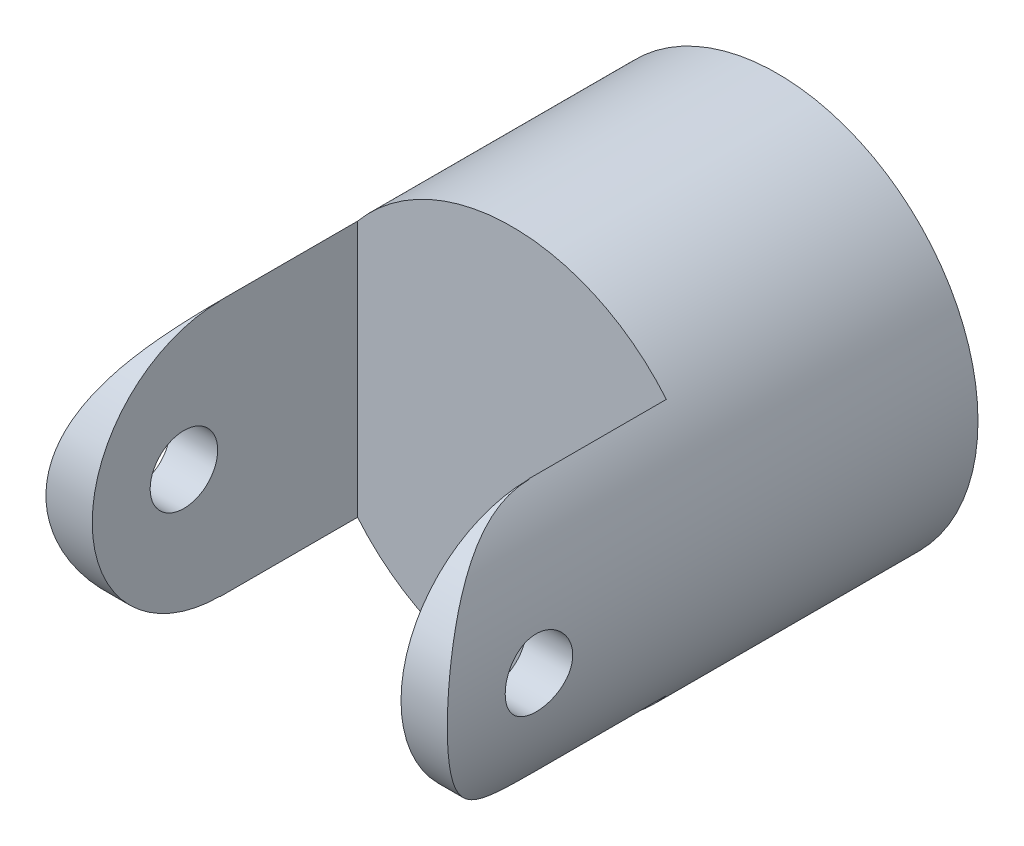
ISO-10303-21;
HEADER;
FILE_DESCRIPTION(('STEP AP214'),'2;1');
FILE_NAME('part.step','',(''),(''),'','','');
FILE_SCHEMA(('AUTOMOTIVE_DESIGN { 1 0 10303 214 1 1 1 1 }'));
ENDSEC;
DATA;
#1=APPLICATION_CONTEXT('core data for automotive mechanical design processes');
#2=APPLICATION_PROTOCOL_DEFINITION('international standard','automotive_design',2000,#1);
#3=PRODUCT_CONTEXT('',#1,'mechanical');
#4=PRODUCT('Part','Part','',(#3));
#5=PRODUCT_RELATED_PRODUCT_CATEGORY('part','',(#4));
#6=PRODUCT_DEFINITION_FORMATION('','',#4);
#7=PRODUCT_DEFINITION_CONTEXT('part definition',#1,'design');
#8=PRODUCT_DEFINITION('design','',#6,#7);
#9=PRODUCT_DEFINITION_SHAPE('','',#8);
#10=(LENGTH_UNIT() NAMED_UNIT(*) SI_UNIT(.MILLI.,.METRE.));
#11=(NAMED_UNIT(*) PLANE_ANGLE_UNIT() SI_UNIT($,.RADIAN.));
#12=(NAMED_UNIT(*) SI_UNIT($,.STERADIAN.) SOLID_ANGLE_UNIT());
#13=UNCERTAINTY_MEASURE_WITH_UNIT(LENGTH_MEASURE(1.E-05),#10,'distance_accuracy_value','');
#14=(GEOMETRIC_REPRESENTATION_CONTEXT(3) GLOBAL_UNCERTAINTY_ASSIGNED_CONTEXT((#13)) GLOBAL_UNIT_ASSIGNED_CONTEXT((#10,
#11,#12)) REPRESENTATION_CONTEXT('',''));
#15=CARTESIAN_POINT('',(0.,0.,0.));
#16=DIRECTION('',(0.,0.,1.));
#17=DIRECTION('',(1.,0.,0.));
#18=AXIS2_PLACEMENT_3D('',#15,#16,#17);
#19=CARTESIAN_POINT('',(0.,0.,11.));
#20=DIRECTION('',(0.,0.,-1.));
#21=DIRECTION('',(-1.,0.,0.));
#22=AXIS2_PLACEMENT_3D('',#19,#20,#21);
#23=CYLINDRICAL_SURFACE('',#22,4.16);
#24=CARTESIAN_POINT('',(-4.16,0.,8.4));
#25=CARTESIAN_POINT('',(-4.1599993277621,0.0390239125747628,8.40000155977883));
#26=CARTESIAN_POINT('',(-4.15944517372982,0.0780689849075887,8.4032743076211));
#27=CARTESIAN_POINT('',(-4.15728790947244,0.155063659220866,8.41627316724561));
#28=CARTESIAN_POINT('',(-4.1556838404645,0.193012226766777,8.42600517774355));
#29=CARTESIAN_POINT('',(-4.15160662871372,0.266688829253378,8.4516200868742));
#30=CARTESIAN_POINT('',(-4.1491342024726,0.302418666403529,8.46749791554888));
#31=CARTESIAN_POINT('',(-4.14359199062741,0.37070263465631,8.50494038987474));
#32=CARTESIAN_POINT('',(-4.14052227188301,0.403257120589323,8.52650439912268));
#33=CARTESIAN_POINT('',(-4.13409224580627,0.46458772784988,8.57493043107718));
#34=CARTESIAN_POINT('',(-4.13072963903228,0.493328446142046,8.6018369904627));
#35=CARTESIAN_POINT('',(-4.12411038432244,0.545909827859605,8.66008848698301));
#36=CARTESIAN_POINT('',(-4.12085374315079,0.569750178990013,8.69143370677385));
#37=CARTESIAN_POINT('',(-4.11479287163596,0.61199635700962,8.75791645283517));
#38=CARTESIAN_POINT('',(-4.11199161196014,0.630367102184491,8.79307656609853));
#39=CARTESIAN_POINT('',(-4.10719060804984,0.660928230525133,8.86603863677661));
#40=CARTESIAN_POINT('',(-4.10519080860076,0.673119039457476,8.90384041198986));
#41=CARTESIAN_POINT('',(-4.1022420557679,0.69086254711526,8.98063721227013));
#42=CARTESIAN_POINT('',(-4.10128342559077,0.696476412201096,9.01961772655558));
#43=CARTESIAN_POINT('',(-4.10049628461693,0.701096337075264,9.09797832626149));
#44=CARTESIAN_POINT('',(-4.10066769229779,0.700102873524991,9.13735838265381));
#45=CARTESIAN_POINT('',(-4.1021124270041,0.691586147504626,9.21496310071234));
#46=CARTESIAN_POINT('',(-4.10337414803079,0.68413165787628,9.25319555739738));
#47=CARTESIAN_POINT('',(-4.10683917312899,0.663012441156744,9.32785926339887));
#48=CARTESIAN_POINT('',(-4.10904251006289,0.649347497319705,9.3642904498015));
#49=CARTESIAN_POINT('',(-4.11415501382972,0.616125724703303,9.43452301139548));
#50=CARTESIAN_POINT('',(-4.11706758136741,0.596540395518846,9.46831064744649));
#51=CARTESIAN_POINT('',(-4.12326802042378,0.552054037069553,9.53214599064827));
#52=CARTESIAN_POINT('',(-4.12655592279497,0.527152570671694,9.56219338992663));
#53=CARTESIAN_POINT('',(-4.13318753266133,0.47236637629369,9.61809336013438));
#54=CARTESIAN_POINT('',(-4.13653142033276,0.442422655344115,9.64388812707109));
#55=CARTESIAN_POINT('',(-4.14285984072331,0.37860130707401,9.69009584686133));
#56=CARTESIAN_POINT('',(-4.14584437104319,0.344723653491564,9.71050876378405));
#57=CARTESIAN_POINT('',(-4.1511221620187,0.273941318469586,9.74537883203141));
#58=CARTESIAN_POINT('',(-4.15341482187015,0.237034041344438,9.75983081098754));
#59=CARTESIAN_POINT('',(-4.1570457409022,0.161268902511086,9.78231477164084));
#60=CARTESIAN_POINT('',(-4.15838408148438,0.122411207472467,9.7903473009117));
#61=CARTESIAN_POINT('',(-4.15994460407459,0.0443464102274835,9.79968583493131));
#62=CARTESIAN_POINT('',(-4.16017995079601,0.00514905333311402,9.80107118148655));
#63=CARTESIAN_POINT('',(-4.1595440480163,-0.0729176566416257,9.79728764814687));
#64=CARTESIAN_POINT('',(-4.15867284194514,-0.111787022534712,9.79211902548208));
#65=CARTESIAN_POINT('',(-4.15592987811917,-0.187848839546986,9.77544026231971));
#66=CARTESIAN_POINT('',(-4.15406433008375,-0.225050161244746,9.76396946569981));
#67=CARTESIAN_POINT('',(-4.14954102253772,-0.297001702403252,9.73505395660164));
#68=CARTESIAN_POINT('',(-4.14688321783,-0.331751781884226,9.71760890329211));
#69=CARTESIAN_POINT('',(-4.14103756729968,-0.398158605742829,9.67705881107004));
#70=CARTESIAN_POINT('',(-4.13784517038284,-0.429784726143966,9.6539042896113));
#71=CARTESIAN_POINT('',(-4.13129802571993,-0.488730817092044,9.60266051997944));
#72=CARTESIAN_POINT('',(-4.12794326595238,-0.516050468145263,9.57457090600211));
#73=CARTESIAN_POINT('',(-4.12140684889181,-0.565902760035183,9.51389821469653));
#74=CARTESIAN_POINT('',(-4.11822739594523,-0.588381753338073,9.4812707822775));
#75=CARTESIAN_POINT('',(-4.11244297967972,-0.62753977754453,9.41265632538366));
#76=CARTESIAN_POINT('',(-4.10983799789771,-0.6442189948586,9.37666940893314));
#77=CARTESIAN_POINT('',(-4.1055140656407,-0.671224072877987,9.30250651334735));
#78=CARTESIAN_POINT('',(-4.10379141775969,-0.681576481831249,9.26434042661519));
#79=CARTESIAN_POINT('',(-4.10141798088834,-0.695717505748562,9.18677960808961));
#80=CARTESIAN_POINT('',(-4.10076709673286,-0.699506703481541,9.14738498569812));
#81=CARTESIAN_POINT('',(-4.10061503803945,-0.70039725202405,9.06902118945909));
#82=CARTESIAN_POINT('',(-4.10109934457034,-0.697583058792982,9.0300529778608));
#83=CARTESIAN_POINT('',(-4.10313125058084,-0.685529497995793,8.9531529833514));
#84=CARTESIAN_POINT('',(-4.10467884642083,-0.676290152422942,8.91522119689308));
#85=CARTESIAN_POINT('',(-4.10865739445353,-0.651681156604191,8.84150439132123));
#86=CARTESIAN_POINT('',(-4.11108727872626,-0.636318915311279,8.80571683758478));
#87=CARTESIAN_POINT('',(-4.11655762981038,-0.599908920025351,8.73721334940979));
#88=CARTESIAN_POINT('',(-4.1195981278615,-0.578860875120836,8.70449757225273));
#89=CARTESIAN_POINT('',(-4.12599307843607,-0.531375902753995,8.64263988511162));
#90=CARTESIAN_POINT('',(-4.12935088277078,-0.504876889588195,8.61354597472536));
#91=CARTESIAN_POINT('',(-4.13597549546759,-0.447373004296234,8.56018888428044));
#92=CARTESIAN_POINT('',(-4.13924228266241,-0.416367094283321,8.53592681999919));
#93=CARTESIAN_POINT('',(-4.14534350893309,-0.350469460605587,8.49276545794503));
#94=CARTESIAN_POINT('',(-4.14817473607019,-0.315551872090762,8.47390519165113));
#95=CARTESIAN_POINT('',(-4.15305458015047,-0.243010434628081,8.44234710952398));
#96=CARTESIAN_POINT('',(-4.15510397288708,-0.205389312618788,8.42964318151871));
#97=CARTESIAN_POINT('',(-4.15774414448338,-0.139687071677165,8.41350289017298));
#98=CARTESIAN_POINT('',(-4.15858555014462,-0.112002502096261,8.40844745508329));
#99=CARTESIAN_POINT('',(-4.15971371512396,-0.0562156106525505,8.40169547796901));
#100=CARTESIAN_POINT('',(-4.16000048428827,-0.028113296214703,8.39999887631656));
#101=CARTESIAN_POINT('',(-4.16,0.,8.4));
#102=B_SPLINE_CURVE_WITH_KNOTS('',3,(#24,#25,#26,#27,#28,#29,#30,#31,#32,#33,#34,#35,#36,#37,
#38,#39,#40,#41,#42,#43,#44,#45,#46,#47,#48,#49,#50,#51,#52,#53,#54,#55,#56,#57,#58,#59,#60,#61,
#62,#63,#64,#65,#66,#67,#68,#69,#70,#71,#72,#73,#74,#75,#76,#77,#78,#79,#80,#81,#82,#83,#84,#85,
#86,#87,#88,#89,#90,#91,#92,#93,#94,#95,#96,#97,#98,#99,#100,#101),.UNSPECIFIED.,.T.,.F.,(4,2,2,
2,2,2,2,2,2,2,2,2,2,2,2,2,2,2,2,2,2,2,2,2,2,2,2,2,2,2,2,2,2,2,2,2,2,2,4),(0.,0.116968971867076,
0.234044909163309,0.351024470460435,0.467990944836635,0.585976836802057,0.703970245548359,
0.82270491376216,0.941431400641504,1.05904472417866,1.1766495630277,1.29301774815333,
1.40938999485922,1.52633162208068,1.6432828688337,1.76171192378295,1.88014176937935,
1.99867416270379,2.11719644423498,2.23430044546542,2.35139985074145,2.46777638798962,
2.58415956562407,2.70158922800758,2.81902759831333,2.93770721667888,3.05638302021214,
3.17455736019733,3.29272120655945,3.409382015381,3.52604242487508,3.64256209702446,
3.75908773197823,3.87702241655098,3.99498430328666,4.11377819537088,4.23245390293315,
4.31672125379096,4.4009871086749),.UNSPECIFIED.);
#103=CARTESIAN_POINT('',(-4.16,0.,8.4));
#104=VERTEX_POINT('',#103);
#105=EDGE_CURVE('E133',#104,#104,#102,.T.);
#106=ORIENTED_EDGE('',*,*,#105,.T.);
#107=EDGE_LOOP('',(#106));
#108=FACE_BOUND('',#107,.T.);
#109=CARTESIAN_POINT('',(4.16,0.,8.4));
#110=CARTESIAN_POINT('',(4.1599993277621,-0.0390239125747628,8.40000155977883));
#111=CARTESIAN_POINT('',(4.15944517372982,-0.0780689849075887,8.4032743076211));
#112=CARTESIAN_POINT('',(4.15728790947244,-0.155063659220866,8.41627316724561));
#113=CARTESIAN_POINT('',(4.1556838404645,-0.193012226766777,8.42600517774355));
#114=CARTESIAN_POINT('',(4.15160662871372,-0.266688829253378,8.4516200868742));
#115=CARTESIAN_POINT('',(4.1491342024726,-0.302418666403529,8.46749791554888));
#116=CARTESIAN_POINT('',(4.14359199062741,-0.37070263465631,8.50494038987474));
#117=CARTESIAN_POINT('',(4.14052227188301,-0.403257120589323,8.52650439912268));
#118=CARTESIAN_POINT('',(4.13409224580627,-0.46458772784988,8.57493043107718));
#119=CARTESIAN_POINT('',(4.13072963903228,-0.493328446142046,8.6018369904627));
#120=CARTESIAN_POINT('',(4.12411038432244,-0.545909827859605,8.66008848698301));
#121=CARTESIAN_POINT('',(4.12085374315079,-0.569750178990013,8.69143370677385));
#122=CARTESIAN_POINT('',(4.11479287163596,-0.61199635700962,8.75791645283517));
#123=CARTESIAN_POINT('',(4.11199161196014,-0.630367102184491,8.79307656609853));
#124=CARTESIAN_POINT('',(4.10719060804984,-0.660928230525133,8.86603863677661));
#125=CARTESIAN_POINT('',(4.10519080860076,-0.673119039457476,8.90384041198986));
#126=CARTESIAN_POINT('',(4.1022420557679,-0.69086254711526,8.98063721227013));
#127=CARTESIAN_POINT('',(4.10128342559077,-0.696476412201096,9.01961772655558));
#128=CARTESIAN_POINT('',(4.10049628461693,-0.701096337075264,9.09797832626149));
#129=CARTESIAN_POINT('',(4.10066769229779,-0.700102873524991,9.13735838265381));
#130=CARTESIAN_POINT('',(4.1021124270041,-0.691586147504626,9.21496310071234));
#131=CARTESIAN_POINT('',(4.10337414803079,-0.68413165787628,9.25319555739738));
#132=CARTESIAN_POINT('',(4.10683917312899,-0.663012441156744,9.32785926339887));
#133=CARTESIAN_POINT('',(4.10904251006289,-0.649347497319705,9.3642904498015));
#134=CARTESIAN_POINT('',(4.11415501382972,-0.616125724703303,9.43452301139548));
#135=CARTESIAN_POINT('',(4.11706758136741,-0.596540395518846,9.46831064744649));
#136=CARTESIAN_POINT('',(4.12326802042378,-0.552054037069553,9.53214599064827));
#137=CARTESIAN_POINT('',(4.12655592279497,-0.527152570671694,9.56219338992663));
#138=CARTESIAN_POINT('',(4.13318753266133,-0.47236637629369,9.61809336013438));
#139=CARTESIAN_POINT('',(4.13653142033276,-0.442422655344115,9.64388812707109));
#140=CARTESIAN_POINT('',(4.14285984072331,-0.37860130707401,9.69009584686133));
#141=CARTESIAN_POINT('',(4.14584437104319,-0.344723653491564,9.71050876378405));
#142=CARTESIAN_POINT('',(4.1511221620187,-0.273941318469586,9.74537883203141));
#143=CARTESIAN_POINT('',(4.15341482187015,-0.237034041344438,9.75983081098754));
#144=CARTESIAN_POINT('',(4.1570457409022,-0.161268902511086,9.78231477164084));
#145=CARTESIAN_POINT('',(4.15838408148438,-0.122411207472467,9.7903473009117));
#146=CARTESIAN_POINT('',(4.15994460407459,-0.0443464102274835,9.79968583493131));
#147=CARTESIAN_POINT('',(4.16017995079601,-0.00514905333311402,9.80107118148655));
#148=CARTESIAN_POINT('',(4.1595440480163,0.0729176566416257,9.79728764814687));
#149=CARTESIAN_POINT('',(4.15867284194514,0.111787022534712,9.79211902548208));
#150=CARTESIAN_POINT('',(4.15592987811917,0.187848839546986,9.77544026231971));
#151=CARTESIAN_POINT('',(4.15406433008375,0.225050161244746,9.76396946569981));
#152=CARTESIAN_POINT('',(4.14954102253772,0.297001702403252,9.73505395660164));
#153=CARTESIAN_POINT('',(4.14688321783,0.331751781884226,9.71760890329211));
#154=CARTESIAN_POINT('',(4.14103756729968,0.398158605742829,9.67705881107004));
#155=CARTESIAN_POINT('',(4.13784517038284,0.429784726143966,9.6539042896113));
#156=CARTESIAN_POINT('',(4.13129802571993,0.488730817092044,9.60266051997944));
#157=CARTESIAN_POINT('',(4.12794326595238,0.516050468145263,9.57457090600211));
#158=CARTESIAN_POINT('',(4.12140684889181,0.565902760035183,9.51389821469653));
#159=CARTESIAN_POINT('',(4.11822739594523,0.588381753338073,9.4812707822775));
#160=CARTESIAN_POINT('',(4.11244297967972,0.62753977754453,9.41265632538366));
#161=CARTESIAN_POINT('',(4.10983799789771,0.6442189948586,9.37666940893314));
#162=CARTESIAN_POINT('',(4.1055140656407,0.671224072877987,9.30250651334735));
#163=CARTESIAN_POINT('',(4.10379141775969,0.681576481831249,9.26434042661519));
#164=CARTESIAN_POINT('',(4.10141798088834,0.695717505748562,9.18677960808961));
#165=CARTESIAN_POINT('',(4.10076709673286,0.699506703481541,9.14738498569812));
#166=CARTESIAN_POINT('',(4.10061503803945,0.70039725202405,9.06902118945909));
#167=CARTESIAN_POINT('',(4.10109934457034,0.697583058792982,9.0300529778608));
#168=CARTESIAN_POINT('',(4.10313125058084,0.685529497995793,8.9531529833514));
#169=CARTESIAN_POINT('',(4.10467884642083,0.676290152422942,8.91522119689308));
#170=CARTESIAN_POINT('',(4.10865739445353,0.651681156604191,8.84150439132123));
#171=CARTESIAN_POINT('',(4.11108727872626,0.636318915311279,8.80571683758478));
#172=CARTESIAN_POINT('',(4.11655762981038,0.599908920025351,8.73721334940979));
#173=CARTESIAN_POINT('',(4.1195981278615,0.578860875120836,8.70449757225273));
#174=CARTESIAN_POINT('',(4.12599307843607,0.531375902753995,8.64263988511162));
#175=CARTESIAN_POINT('',(4.12935088277078,0.504876889588195,8.61354597472536));
#176=CARTESIAN_POINT('',(4.13597549546759,0.447373004296234,8.56018888428044));
#177=CARTESIAN_POINT('',(4.13924228266241,0.416367094283321,8.53592681999919));
#178=CARTESIAN_POINT('',(4.14534350893309,0.350469460605587,8.49276545794503));
#179=CARTESIAN_POINT('',(4.14817473607019,0.315551872090762,8.47390519165113));
#180=CARTESIAN_POINT('',(4.15305458015047,0.243010434628081,8.44234710952398));
#181=CARTESIAN_POINT('',(4.15510397288708,0.205389312618788,8.42964318151871));
#182=CARTESIAN_POINT('',(4.15774414448338,0.139687071677165,8.41350289017298));
#183=CARTESIAN_POINT('',(4.15858555014462,0.112002502096261,8.40844745508329));
#184=CARTESIAN_POINT('',(4.15971371512396,0.0562156106525505,8.40169547796901));
#185=CARTESIAN_POINT('',(4.16000048428827,0.028113296214703,8.39999887631656));
#186=CARTESIAN_POINT('',(4.16,0.,8.4));
#187=B_SPLINE_CURVE_WITH_KNOTS('',3,(#109,#110,#111,#112,#113,#114,#115,#116,#117,#118,#119,
#120,#121,#122,#123,#124,#125,#126,#127,#128,#129,#130,#131,#132,#133,#134,#135,#136,#137,#138,
#139,#140,#141,#142,#143,#144,#145,#146,#147,#148,#149,#150,#151,#152,#153,#154,#155,#156,#157,
#158,#159,#160,#161,#162,#163,#164,#165,#166,#167,#168,#169,#170,#171,#172,#173,#174,#175,#176,
#177,#178,#179,#180,#181,#182,#183,#184,#185,#186),.UNSPECIFIED.,.T.,.F.,(4,2,2,2,2,2,2,2,2,2,2,
2,2,2,2,2,2,2,2,2,2,2,2,2,2,2,2,2,2,2,2,2,2,2,2,2,2,2,4),(0.,0.116968971867076,
0.234044909163309,0.351024470460435,0.467990944836635,0.585976836802057,0.703970245548359,
0.82270491376216,0.941431400641504,1.05904472417866,1.1766495630277,1.29301774815333,
1.40938999485922,1.52633162208068,1.6432828688337,1.76171192378295,1.88014176937935,
1.99867416270379,2.11719644423498,2.23430044546542,2.35139985074145,2.46777638798962,
2.58415956562407,2.70158922800758,2.81902759831333,2.93770721667888,3.05638302021214,
3.17455736019733,3.29272120655945,3.409382015381,3.52604242487508,3.64256209702446,
3.75908773197823,3.87702241655098,3.99498430328666,4.11377819537088,4.23245390293315,
4.31672125379096,4.4009871086749),.UNSPECIFIED.);
#188=CARTESIAN_POINT('',(4.16,0.,8.4));
#189=VERTEX_POINT('',#188);
#190=EDGE_CURVE('E140',#189,#189,#187,.T.);
#191=ORIENTED_EDGE('',*,*,#190,.T.);
#192=EDGE_LOOP('',(#191));
#193=FACE_BOUND('',#192,.T.);
#194=DIRECTION('',(0.,0.,-1.));
#195=VECTOR('',#194,1.);
#196=CARTESIAN_POINT('',(3.2,2.65811963613378,11.));
#197=LINE('',#196,#195);
#198=CARTESIAN_POINT('',(3.2,2.65811963613378,5.5));
#199=VERTEX_POINT('',#198);
#200=CARTESIAN_POINT('',(3.2,2.65811963613378,8.35));
#201=VERTEX_POINT('',#200);
#202=EDGE_CURVE('E184',#199,#201,#197,.F.);
#203=ORIENTED_EDGE('',*,*,#202,.T.);
#204=CARTESIAN_POINT('',(0.,0.,8.35));
#205=DIRECTION('',(0.,0.,-1.));
#206=DIRECTION('',(-1.,0.,0.));
#207=AXIS2_PLACEMENT_3D('',#204,#205,#206);
#208=CIRCLE('',#207,4.16);
#209=CARTESIAN_POINT('',(3.20672730365399,2.65,8.35));
#210=VERTEX_POINT('',#209);
#211=EDGE_CURVE('E109',#201,#210,#208,.T.);
#212=ORIENTED_EDGE('',*,*,#211,.T.);
#213=CARTESIAN_POINT('',(3.20672730365399,2.65,8.35));
#214=CARTESIAN_POINT('',(3.20669505811809,2.6500160283953,8.41600762728984));
#215=CARTESIAN_POINT('',(3.20876451539116,2.64753446292586,8.48199574117056));
#216=CARTESIAN_POINT('',(3.21686000468512,2.63770436351235,8.6132897334531));
#217=CARTESIAN_POINT('',(3.22288144484862,2.63036147790947,8.67859631438047));
#218=CARTESIAN_POINT('',(3.23856426362669,2.61102379201802,8.8074575561479));
#219=CARTESIAN_POINT('',(3.24819241085993,2.59907143356764,8.87102269200466));
#220=CARTESIAN_POINT('',(3.27067722024509,2.57071954376607,8.99656510040091));
#221=CARTESIAN_POINT('',(3.28353467768257,2.55431891685561,9.05854197764881));
#222=CARTESIAN_POINT('',(3.32611454748676,2.49894471907308,9.24098633080575));
#223=CARTESIAN_POINT('',(3.35993644993818,2.45369268273078,9.35865168939531));
#224=CARTESIAN_POINT('',(3.43457647325418,2.34807721097754,9.58478456622257));
#225=CARTESIAN_POINT('',(3.47541252786229,2.28767485244232,9.69322741462268));
#226=CARTESIAN_POINT('',(3.56626107151885,2.14373021273325,9.91416620206438));
#227=CARTESIAN_POINT('',(3.61676021769055,2.05813888489881,10.0251318104465));
#228=CARTESIAN_POINT('',(3.71728722279422,1.87049295958019,10.2323745995469));
#229=CARTESIAN_POINT('',(3.76731489010916,1.76843195013416,10.3286460310212));
#230=CARTESIAN_POINT('',(3.86884717703238,1.5348454058189,10.5160688473868));
#231=CARTESIAN_POINT('',(3.91972805251957,1.40122264248246,10.6050055882579));
#232=CARTESIAN_POINT('',(3.98736678964662,1.18831579844764,10.7200076573631));
#233=CARTESIAN_POINT('',(4.00847126438806,1.11524286278054,10.7552827883369));
#234=CARTESIAN_POINT('',(4.04716932801902,0.965395181767101,10.8192372236001));
#235=CARTESIAN_POINT('',(4.06476539462032,0.888623096755101,10.8479211849109));
#236=CARTESIAN_POINT('',(4.09424894951388,0.740165723076318,10.8956013634813));
#237=CARTESIAN_POINT('',(4.10654021793189,0.66878394332158,10.9152955999517));
#238=CARTESIAN_POINT('',(4.1274934437329,0.524149274703781,10.9487057885936));
#239=CARTESIAN_POINT('',(4.13615753349387,0.450897512134977,10.9624252534582));
#240=CARTESIAN_POINT('',(4.14959852568186,0.303189053306739,10.9836545651541));
#241=CARTESIAN_POINT('',(4.1543779963417,0.228733186382834,10.9911685146823));
#242=CARTESIAN_POINT('',(4.1599167354821,0.0793302960709673,10.9998707866687));
#243=CARTESIAN_POINT('',(4.16067649481135,0.00438333376997673,11.0010598814578));
#244=CARTESIAN_POINT('',(4.15721299561737,-0.199206688897612,10.9956282507606));
#245=CARTESIAN_POINT('',(4.14901150521583,-0.327688754379458,10.9827733557036));
#246=CARTESIAN_POINT('',(4.12131045618796,-0.580151905277748,10.9388954717403));
#247=CARTESIAN_POINT('',(4.10180999423465,-0.704132629980009,10.9078710302181));
#248=CARTESIAN_POINT('',(4.05316605362649,-0.944735368137761,10.8291156027387));
#249=CARTESIAN_POINT('',(4.02401422814085,-1.06135090761252,10.7813701538064));
#250=CARTESIAN_POINT('',(3.95829117182254,-1.28496546345559,10.6709765815365));
#251=CARTESIAN_POINT('',(3.92171885331419,-1.3919630667314,10.6083262732527));
#252=CARTESIAN_POINT('',(3.83867583176293,-1.60784718202649,10.4610422617027));
#253=CARTESIAN_POINT('',(3.79153825590707,-1.7152617391232,10.3746305218407));
#254=CARTESIAN_POINT('',(3.69466426676838,-1.9150511808397,10.186823635248));
#255=CARTESIAN_POINT('',(3.64492307670927,-2.00739704388281,10.0854002765597));
#256=CARTESIAN_POINT('',(3.54020951927387,-2.18741463652778,9.85403254771881));
#257=CARTESIAN_POINT('',(3.48546866291426,-2.27266094269475,9.72208345679977));
#258=CARTESIAN_POINT('',(3.38529956286428,-2.41934756100157,9.44267970306101));
#259=CARTESIAN_POINT('',(3.33983524936024,-2.48088093909605,9.29528860523034));
#260=CARTESIAN_POINT('',(3.28801692378069,-2.54855896361415,9.0791554870462));
#261=CARTESIAN_POINT('',(3.2744440105472,-2.56592756537774,9.0155136448719));
#262=CARTESIAN_POINT('',(3.25068197969008,-2.5959646101103,8.88651346554289));
#263=CARTESIAN_POINT('',(3.24049146008133,-2.60863500071993,8.82115585171927));
#264=CARTESIAN_POINT('',(3.22387519894656,-2.62914734735592,8.68855789981288));
#265=CARTESIAN_POINT('',(3.21748644109494,-2.63694190737749,8.6213055264091));
#266=CARTESIAN_POINT('',(3.20889148108242,-2.64738082111482,8.48604368824188));
#267=CARTESIAN_POINT('',(3.20669125515124,-2.65001781612364,8.41803328076841));
#268=CARTESIAN_POINT('',(3.20672730365399,-2.65,8.35));
#269=B_SPLINE_CURVE_WITH_KNOTS('',3,(#213,#214,#215,#216,#217,#218,#219,#220,#221,#222,#223,
#224,#225,#226,#227,#228,#229,#230,#231,#232,#233,#234,#235,#236,#237,#238,#239,#240,#241,#242,
#243,#244,#245,#246,#247,#248,#249,#250,#251,#252,#253,#254,#255,#256,#257,#258,#259,#260,#261,
#262,#263,#264,#265,#266,#267,#268),.UNSPECIFIED.,.F.,.F.,(4,2,2,2,2,2,2,2,2,2,2,2,2,2,2,2,2,2,
2,2,2,2,2,2,2,2,2,4),(0.,0.197912306414299,0.395595062230328,0.591499506597758,
0.787452243942295,1.17728912478481,1.56813799322805,2.01329217126134,2.45862007630531,
2.96067962611412,3.21186909182646,3.46288052896882,3.68773681749321,3.91246072924424,
4.1370359484587,4.36158374406302,4.74768030588197,5.13380773949987,5.5202699855289,
5.90678891911809,6.34218253133714,6.77840503827903,7.27514024766802,7.7699055719821,
7.97174320317075,8.17349706889667,8.37718281200512,8.58115895832141),.UNSPECIFIED.);
#270=CARTESIAN_POINT('',(3.20672730365399,-2.65,8.35));
#271=VERTEX_POINT('',#270);
#272=EDGE_CURVE('E110',#210,#271,#269,.T.);
#273=ORIENTED_EDGE('',*,*,#272,.T.);
#274=CARTESIAN_POINT('',(0.,0.,8.35));
#275=DIRECTION('',(0.,0.,-1.));
#276=DIRECTION('',(-1.,0.,0.));
#277=AXIS2_PLACEMENT_3D('',#274,#275,#276);
#278=CIRCLE('',#277,4.16);
#279=CARTESIAN_POINT('',(3.2,-2.65811963613378,8.35));
#280=VERTEX_POINT('',#279);
#281=EDGE_CURVE('E123',#271,#280,#278,.T.);
#282=ORIENTED_EDGE('',*,*,#281,.T.);
#283=DIRECTION('',(0.,0.,-1.));
#284=VECTOR('',#283,1.);
#285=CARTESIAN_POINT('',(3.2,-2.65811963613378,11.));
#286=LINE('',#285,#284);
#287=CARTESIAN_POINT('',(3.2,-2.65811963613378,5.5));
#288=VERTEX_POINT('',#287);
#289=EDGE_CURVE('E189',#280,#288,#286,.T.);
#290=ORIENTED_EDGE('',*,*,#289,.T.);
#291=CARTESIAN_POINT('',(0.,0.,5.5));
#292=DIRECTION('',(0.,0.,-1.));
#293=DIRECTION('',(-1.,0.,0.));
#294=AXIS2_PLACEMENT_3D('',#291,#292,#293);
#295=CIRCLE('',#294,4.16);
#296=CARTESIAN_POINT('',(-3.2,-2.65811963613378,5.5));
#297=VERTEX_POINT('',#296);
#298=EDGE_CURVE('E200',#288,#297,#295,.T.);
#299=ORIENTED_EDGE('',*,*,#298,.T.);
#300=DIRECTION('',(0.,0.,-1.));
#301=VECTOR('',#300,1.);
#302=CARTESIAN_POINT('',(-3.2,-2.65811963613378,11.));
#303=LINE('',#302,#301);
#304=CARTESIAN_POINT('',(-3.2,-2.65811963613378,8.35));
#305=VERTEX_POINT('',#304);
#306=EDGE_CURVE('E120',#297,#305,#303,.F.);
#307=ORIENTED_EDGE('',*,*,#306,.T.);
#308=CARTESIAN_POINT('',(-3.20672730365399,-2.65,8.35));
#309=VERTEX_POINT('',#308);
#310=EDGE_CURVE('E48',#305,#309,#278,.T.);
#311=ORIENTED_EDGE('',*,*,#310,.T.);
#312=CARTESIAN_POINT('',(-3.20672730365399,-2.65,8.35));
#313=CARTESIAN_POINT('',(-3.2066950569446,-2.65001603233073,8.41600786618289));
#314=CARTESIAN_POINT('',(-3.20876452986633,-2.6475344468261,8.48199622095595));
#315=CARTESIAN_POINT('',(-3.21686007840042,-2.63770427239442,8.61329068726936));
#316=CARTESIAN_POINT('',(-3.22288156206535,-2.63036133191998,8.67859750135164));
#317=CARTESIAN_POINT('',(-3.23856443279243,-2.61102358495306,8.80745872341925));
#318=CARTESIAN_POINT('',(-3.24819256173721,-2.59907125438728,8.87102361493784));
#319=CARTESIAN_POINT('',(-3.27067731712963,-2.5707194105278,8.99656556076683));
#320=CARTESIAN_POINT('',(-3.2835347388135,-2.55431880173449,9.0585422198147));
#321=CARTESIAN_POINT('',(-3.32611457476561,-2.49894475446523,9.24098648701093));
#322=CARTESIAN_POINT('',(-3.35993646170183,-2.45369304916129,9.35865186754687));
#323=CARTESIAN_POINT('',(-3.43457669832319,-2.34807650845614,9.58478510498086));
#324=CARTESIAN_POINT('',(-3.47541296077156,-2.28767279258207,9.69322832394361));
#325=CARTESIAN_POINT('',(-3.56625955812675,-2.14373417542528,9.91416268500063));
#326=CARTESIAN_POINT('',(-3.61675627016061,-2.0581516201372,10.0251233979166));
#327=CARTESIAN_POINT('',(-3.71728660122356,-1.87048875196189,10.2323735925183));
#328=CARTESIAN_POINT('',(-3.76732000894074,-1.76840126866439,10.3286566621578));
#329=CARTESIAN_POINT('',(-3.8688492910669,-1.53486185874963,10.5160714169269));
#330=CARTESIAN_POINT('',(-3.91971761678179,-1.40132533167105,10.6049793697717));
#331=CARTESIAN_POINT('',(-4.00989192119378,-1.1173435286487,10.7583142524245));
#332=CARTESIAN_POINT('',(-4.04921277108696,-0.966920348216277,10.8227727005503));
#333=CARTESIAN_POINT('',(-4.10598842074772,-0.681066195574498,10.9145838034583));
#334=CARTESIAN_POINT('',(-4.1260630588641,-0.547606621993921,10.9464514106566));
#335=CARTESIAN_POINT('',(-4.15306256562993,-0.276091731297322,10.9891499003433));
#336=CARTESIAN_POINT('',(-4.15999800756453,-0.138040200507549,10.9999976979112));
#337=CARTESIAN_POINT('',(-4.16000193935794,0.134362875325561,11.0000022407623));
#338=CARTESIAN_POINT('',(-4.15343491637915,0.268715015994844,10.9897291270513));
#339=CARTESIAN_POINT('',(-4.12783259780039,0.533163012478475,10.9492585268422));
#340=CARTESIAN_POINT('',(-4.10879262488342,0.66325725237042,10.9190535659328));
#341=CARTESIAN_POINT('',(-4.06013823412719,0.915023056300292,10.8404949745796));
#342=CARTESIAN_POINT('',(-4.0305701571117,1.0367287848497,10.7922208310381));
#343=CARTESIAN_POINT('',(-3.96329579799949,1.26989365901362,10.6795181501988));
#344=CARTESIAN_POINT('',(-3.92558868360515,1.38135175504229,10.6150879606754));
#345=CARTESIAN_POINT('',(-3.8415043235843,1.60105499277028,10.4661628419323));
#346=CARTESIAN_POINT('',(-3.79467192621944,1.70830638298094,10.3804643891463));
#347=CARTESIAN_POINT('',(-3.6983459740994,1.90791855907305,10.1941862081327));
#348=CARTESIAN_POINT('',(-3.64884786884299,2.0002527322788,10.0935804846254));
#349=CARTESIAN_POINT('',(-3.54431232561143,2.18077977305783,9.8636200954213));
#350=CARTESIAN_POINT('',(-3.48949306427323,2.26649898089916,9.7322116169376));
#351=CARTESIAN_POINT('',(-3.38894825584364,2.41425361264903,9.453860852767));
#352=CARTESIAN_POINT('',(-3.34318836242538,2.4763793417481,9.30698060265994));
#353=CARTESIAN_POINT('',(-3.29052405428252,2.54532856298086,9.09044275214302));
#354=CARTESIAN_POINT('',(-3.27655217465774,2.56323955814269,9.02589410258745));
#355=CARTESIAN_POINT('',(-3.25207648674413,2.59422181579563,8.89500400208282));
#356=CARTESIAN_POINT('',(-3.2415712138379,2.60729512246083,8.82866332110424));
#357=CARTESIAN_POINT('',(-3.22443216118824,2.62846658002187,8.69401504794051));
#358=CARTESIAN_POINT('',(-3.21783735754271,2.63651468478133,8.62569454704852));
#359=CARTESIAN_POINT('',(-3.2089625245374,2.64729484638864,8.48825826349253));
#360=CARTESIAN_POINT('',(-3.20668894286933,2.65001895948402,8.41914144698602));
#361=CARTESIAN_POINT('',(-3.20672730365399,2.65,8.35));
#362=B_SPLINE_CURVE_WITH_KNOTS('',3,(#312,#313,#314,#315,#316,#317,#318,#319,#320,#321,#322,
#323,#324,#325,#326,#327,#328,#329,#330,#331,#332,#333,#334,#335,#336,#337,#338,#339,#340,#341,
#342,#343,#344,#345,#346,#347,#348,#349,#350,#351,#352,#353,#354,#355,#356,#357,#358,#359,#360,
#361),.UNSPECIFIED.,.F.,.F.,(4,2,2,2,2,2,2,2,2,2,2,2,2,2,2,2,2,2,2,2,2,2,2,2,4),(0.,
0.19791302635126,0.395596498391126,0.591500226042087,0.787452243756272,1.17728974135386,
1.56813799281474,2.01328207878496,2.45862007564806,2.96076458630949,3.46225955502895,
3.87614858071767,4.28970440272061,4.69224329463494,5.09493322384377,5.49587213783643,
5.89685207126567,6.33035331513185,6.76461959349507,7.26089080684145,7.75524290024823,
7.96030445067044,8.16527925274726,8.37226414197891,8.5795576314723),.UNSPECIFIED.);
#363=CARTESIAN_POINT('',(-3.20672730365399,2.65,8.35));
#364=VERTEX_POINT('',#363);
#365=EDGE_CURVE('E102',#309,#364,#362,.T.);
#366=ORIENTED_EDGE('',*,*,#365,.T.);
#367=CARTESIAN_POINT('',(-3.2,2.65811963613378,8.35));
#368=VERTEX_POINT('',#367);
#369=EDGE_CURVE('E179',#364,#368,#208,.T.);
#370=ORIENTED_EDGE('',*,*,#369,.T.);
#371=DIRECTION('',(0.,0.,-1.));
#372=VECTOR('',#371,1.);
#373=CARTESIAN_POINT('',(-3.2,2.65811963613378,11.));
#374=LINE('',#373,#372);
#375=CARTESIAN_POINT('',(-3.2,2.65811963613378,5.5));
#376=VERTEX_POINT('',#375);
#377=EDGE_CURVE('E192',#368,#376,#374,.T.);
#378=ORIENTED_EDGE('',*,*,#377,.T.);
#379=EDGE_CURVE('E197',#376,#199,#295,.T.);
#380=ORIENTED_EDGE('',*,*,#379,.T.);
#381=EDGE_LOOP('',(#203,#212,#273,#282,#290,#299,#307,#311,#366,#370,#378,#380));
#382=FACE_BOUND('',#381,.T.);
#383=CARTESIAN_POINT('',(0.,0.,0.));
#384=DIRECTION('',(0.,0.,1.));
#385=DIRECTION('',(1.,0.,0.));
#386=AXIS2_PLACEMENT_3D('',#383,#384,#385);
#387=CIRCLE('',#386,4.16);
#388=CARTESIAN_POINT('',(4.16,0.,0.));
#389=VERTEX_POINT('',#388);
#390=EDGE_CURVE('E194',#389,#389,#387,.T.);
#391=ORIENTED_EDGE('',*,*,#390,.T.);
#392=EDGE_LOOP('',(#391));
#393=FACE_BOUND('',#392,.T.);
#394=ADVANCED_FACE('F32',(#108,#193,#382,#393),#23,.T.);
#395=CARTESIAN_POINT('',(0.,0.,0.));
#396=DIRECTION('',(0.,0.,1.));
#397=DIRECTION('',(1.,0.,0.));
#398=AXIS2_PLACEMENT_3D('',#395,#396,#397);
#399=PLANE('',#398);
#400=ORIENTED_EDGE('',*,*,#390,.F.);
#401=EDGE_LOOP('',(#400));
#402=FACE_BOUND('',#401,.T.);
#403=ADVANCED_FACE('F220',(#402),#399,.F.);
#404=CARTESIAN_POINT('',(-3.2,-4.16,5.5));
#405=DIRECTION('',(0.,0.,-1.));
#406=DIRECTION('',(-1.,0.,0.));
#407=AXIS2_PLACEMENT_3D('',#404,#405,#406);
#408=PLANE('',#407);
#409=DIRECTION('',(0.,1.,0.));
#410=VECTOR('',#409,1.);
#411=CARTESIAN_POINT('',(-3.2,-4.16,5.5));
#412=LINE('',#411,#410);
#413=EDGE_CURVE('E181',#297,#376,#412,.T.);
#414=ORIENTED_EDGE('',*,*,#413,.F.);
#415=ORIENTED_EDGE('',*,*,#298,.F.);
#416=DIRECTION('',(0.,1.,0.));
#417=VECTOR('',#416,1.);
#418=CARTESIAN_POINT('',(3.2,-4.16,5.5));
#419=LINE('',#418,#417);
#420=EDGE_CURVE('E185',#288,#199,#419,.T.);
#421=ORIENTED_EDGE('',*,*,#420,.T.);
#422=ORIENTED_EDGE('',*,*,#379,.F.);
#423=EDGE_LOOP('',(#414,#415,#421,#422));
#424=FACE_BOUND('',#423,.T.);
#425=ADVANCED_FACE('F224',(#424),#408,.F.);
#426=CARTESIAN_POINT('',(-3.2,-4.16,11.8574060192512));
#427=DIRECTION('',(-1.,0.,0.));
#428=DIRECTION('',(0.,0.,1.));
#429=AXIS2_PLACEMENT_3D('',#426,#427,#428);
#430=PLANE('',#429);
#431=CARTESIAN_POINT('',(-3.2,0.,9.1));
#432=DIRECTION('',(-1.,0.,0.));
#433=DIRECTION('',(0.,0.,1.));
#434=AXIS2_PLACEMENT_3D('',#431,#432,#433);
#435=CIRCLE('',#434,0.7);
#436=CARTESIAN_POINT('',(-3.2,0.,9.8));
#437=VERTEX_POINT('',#436);
#438=EDGE_CURVE('E144',#437,#437,#435,.T.);
#439=ORIENTED_EDGE('',*,*,#438,.T.);
#440=EDGE_LOOP('',(#439));
#441=FACE_BOUND('',#440,.T.);
#442=ORIENTED_EDGE('',*,*,#377,.F.);
#443=DIRECTION('',(0.,-1.,0.));
#444=VECTOR('',#443,1.);
#445=CARTESIAN_POINT('',(-3.2,-4.16,8.35));
#446=LINE('',#445,#444);
#447=CARTESIAN_POINT('',(-3.2,2.65,8.35));
#448=VERTEX_POINT('',#447);
#449=EDGE_CURVE('E178',#368,#448,#446,.T.);
#450=ORIENTED_EDGE('',*,*,#449,.T.);
#451=CARTESIAN_POINT('',(-3.2,0.,8.35));
#452=DIRECTION('',(-1.,0.,0.));
#453=DIRECTION('',(0.,0.,1.));
#454=AXIS2_PLACEMENT_3D('',#451,#452,#453);
#455=CIRCLE('',#454,2.65);
#456=CARTESIAN_POINT('',(-3.2,-2.65,8.35));
#457=VERTEX_POINT('',#456);
#458=EDGE_CURVE('E121',#448,#457,#455,.F.);
#459=ORIENTED_EDGE('',*,*,#458,.T.);
#460=DIRECTION('',(0.,-1.,0.));
#461=VECTOR('',#460,1.);
#462=CARTESIAN_POINT('',(-3.2,-4.16,8.35));
#463=LINE('',#462,#461);
#464=EDGE_CURVE('E113',#457,#305,#463,.T.);
#465=ORIENTED_EDGE('',*,*,#464,.T.);
#466=ORIENTED_EDGE('',*,*,#306,.F.);
#467=ORIENTED_EDGE('',*,*,#413,.T.);
#468=EDGE_LOOP('',(#442,#450,#459,#465,#466,#467));
#469=FACE_BOUND('',#468,.T.);
#470=ADVANCED_FACE('F215',(#441,#469),#430,.F.);
#471=CARTESIAN_POINT('',(3.2,-4.16,11.8574060192512));
#472=DIRECTION('',(1.,0.,0.));
#473=DIRECTION('',(0.,0.,-1.));
#474=AXIS2_PLACEMENT_3D('',#471,#472,#473);
#475=PLANE('',#474);
#476=CARTESIAN_POINT('',(3.2,0.,9.1));
#477=DIRECTION('',(1.,0.,0.));
#478=DIRECTION('',(0.,0.,-1.));
#479=AXIS2_PLACEMENT_3D('',#476,#477,#478);
#480=CIRCLE('',#479,0.7);
#481=CARTESIAN_POINT('',(3.2,0.,8.4));
#482=VERTEX_POINT('',#481);
#483=EDGE_CURVE('E36',#482,#482,#480,.T.);
#484=ORIENTED_EDGE('',*,*,#483,.T.);
#485=EDGE_LOOP('',(#484));
#486=FACE_BOUND('',#485,.T.);
#487=CARTESIAN_POINT('',(3.2,0.,8.35));
#488=DIRECTION('',(1.,0.,0.));
#489=DIRECTION('',(0.,0.,-1.));
#490=AXIS2_PLACEMENT_3D('',#487,#488,#489);
#491=CIRCLE('',#490,2.65);
#492=CARTESIAN_POINT('',(3.2,-2.65,8.35));
#493=VERTEX_POINT('',#492);
#494=CARTESIAN_POINT('',(3.2,2.65,8.35));
#495=VERTEX_POINT('',#494);
#496=EDGE_CURVE('E41',#493,#495,#491,.F.);
#497=ORIENTED_EDGE('',*,*,#496,.T.);
#498=DIRECTION('',(0.,1.,0.));
#499=VECTOR('',#498,1.);
#500=CARTESIAN_POINT('',(3.2,-4.16,8.35));
#501=LINE('',#500,#499);
#502=EDGE_CURVE('E11',#495,#201,#501,.T.);
#503=ORIENTED_EDGE('',*,*,#502,.T.);
#504=ORIENTED_EDGE('',*,*,#202,.F.);
#505=ORIENTED_EDGE('',*,*,#420,.F.);
#506=ORIENTED_EDGE('',*,*,#289,.F.);
#507=DIRECTION('',(0.,1.,0.));
#508=VECTOR('',#507,1.);
#509=CARTESIAN_POINT('',(3.2,-4.16,8.35));
#510=LINE('',#509,#508);
#511=EDGE_CURVE('E201',#280,#493,#510,.T.);
#512=ORIENTED_EDGE('',*,*,#511,.T.);
#513=EDGE_LOOP('',(#497,#503,#504,#505,#506,#512));
#514=FACE_BOUND('',#513,.T.);
#515=ADVANCED_FACE('F206',(#486,#514),#475,.F.);
#516=CARTESIAN_POINT('',(-4.16,-2.65,8.35));
#517=DIRECTION('',(0.,0.,-1.));
#518=DIRECTION('',(-1.,0.,0.));
#519=AXIS2_PLACEMENT_3D('',#516,#517,#518);
#520=PLANE('',#519);
#521=DIRECTION('',(1.,0.,0.));
#522=VECTOR('',#521,1.);
#523=CARTESIAN_POINT('',(-4.16,-2.65,8.35));
#524=LINE('',#523,#522);
#525=EDGE_CURVE('E56',#493,#271,#524,.T.);
#526=ORIENTED_EDGE('',*,*,#525,.F.);
#527=ORIENTED_EDGE('',*,*,#511,.F.);
#528=ORIENTED_EDGE('',*,*,#281,.F.);
#529=EDGE_LOOP('',(#526,#527,#528));
#530=FACE_BOUND('',#529,.T.);
#531=ADVANCED_FACE('F209',(#530),#520,.F.);
#532=CARTESIAN_POINT('',(-4.16,0.,8.35));
#533=DIRECTION('',(1.,0.,0.));
#534=DIRECTION('',(0.,0.,-1.));
#535=AXIS2_PLACEMENT_3D('',#532,#533,#534);
#536=CYLINDRICAL_SURFACE('',#535,2.65);
#537=DIRECTION('',(1.,0.,0.));
#538=VECTOR('',#537,1.);
#539=CARTESIAN_POINT('',(-4.16,2.65,8.35));
#540=LINE('',#539,#538);
#541=EDGE_CURVE('E114',#495,#210,#540,.T.);
#542=ORIENTED_EDGE('',*,*,#541,.F.);
#543=ORIENTED_EDGE('',*,*,#496,.F.);
#544=ORIENTED_EDGE('',*,*,#525,.T.);
#545=ORIENTED_EDGE('',*,*,#272,.F.);
#546=EDGE_LOOP('',(#542,#543,#544,#545));
#547=FACE_BOUND('',#546,.T.);
#548=ADVANCED_FACE('F165',(#547),#536,.T.);
#549=CARTESIAN_POINT('',(-4.16,2.65,8.35));
#550=DIRECTION('',(0.,0.,-1.));
#551=DIRECTION('',(-1.,0.,0.));
#552=AXIS2_PLACEMENT_3D('',#549,#550,#551);
#553=PLANE('',#552);
#554=ORIENTED_EDGE('',*,*,#502,.F.);
#555=ORIENTED_EDGE('',*,*,#541,.T.);
#556=ORIENTED_EDGE('',*,*,#211,.F.);
#557=EDGE_LOOP('',(#554,#555,#556));
#558=FACE_BOUND('',#557,.T.);
#559=ADVANCED_FACE('F161',(#558),#553,.F.);
#560=EDGE_CURVE('E106',#364,#448,#540,.T.);
#561=ORIENTED_EDGE('',*,*,#560,.T.);
#562=ORIENTED_EDGE('',*,*,#449,.F.);
#563=ORIENTED_EDGE('',*,*,#369,.F.);
#564=EDGE_LOOP('',(#561,#562,#563));
#565=FACE_BOUND('',#564,.T.);
#566=ADVANCED_FACE('F157',(#565),#553,.F.);
#567=ORIENTED_EDGE('',*,*,#458,.F.);
#568=ORIENTED_EDGE('',*,*,#560,.F.);
#569=ORIENTED_EDGE('',*,*,#365,.F.);
#570=EDGE_CURVE('E104',#309,#457,#524,.T.);
#571=ORIENTED_EDGE('',*,*,#570,.T.);
#572=EDGE_LOOP('',(#567,#568,#569,#571));
#573=FACE_BOUND('',#572,.T.);
#574=ADVANCED_FACE('F103',(#573),#536,.T.);
#575=ORIENTED_EDGE('',*,*,#464,.F.);
#576=ORIENTED_EDGE('',*,*,#570,.F.);
#577=ORIENTED_EDGE('',*,*,#310,.F.);
#578=EDGE_LOOP('',(#575,#576,#577));
#579=FACE_BOUND('',#578,.T.);
#580=ADVANCED_FACE('F112',(#579),#520,.F.);
#581=CARTESIAN_POINT('',(-4.16,0.,9.1));
#582=DIRECTION('',(1.,0.,0.));
#583=DIRECTION('',(0.,0.,-1.));
#584=AXIS2_PLACEMENT_3D('',#581,#582,#583);
#585=CYLINDRICAL_SURFACE('',#584,0.7);
#586=ORIENTED_EDGE('',*,*,#483,.F.);
#587=EDGE_LOOP('',(#586));
#588=FACE_BOUND('',#587,.T.);
#589=ORIENTED_EDGE('',*,*,#190,.F.);
#590=EDGE_LOOP('',(#589));
#591=FACE_BOUND('',#590,.T.);
#592=ADVANCED_FACE('F155',(#588,#591),#585,.F.);
#593=ORIENTED_EDGE('',*,*,#438,.F.);
#594=EDGE_LOOP('',(#593));
#595=FACE_BOUND('',#594,.T.);
#596=ORIENTED_EDGE('',*,*,#105,.F.);
#597=EDGE_LOOP('',(#596));
#598=FACE_BOUND('',#597,.T.);
#599=ADVANCED_FACE('F151',(#595,#598),#585,.F.);
#600=CLOSED_SHELL('',(#394,#403,#425,#470,#515,#531,#548,#559,#566,#574,#580,#592,#599));
#601=MANIFOLD_SOLID_BREP('B2',#600);
#602=ADVANCED_BREP_SHAPE_REPRESENTATION('',(#18,#601),#14);
#603=SHAPE_DEFINITION_REPRESENTATION(#9,#602);
ENDSEC;
END-ISO-10303-21;
